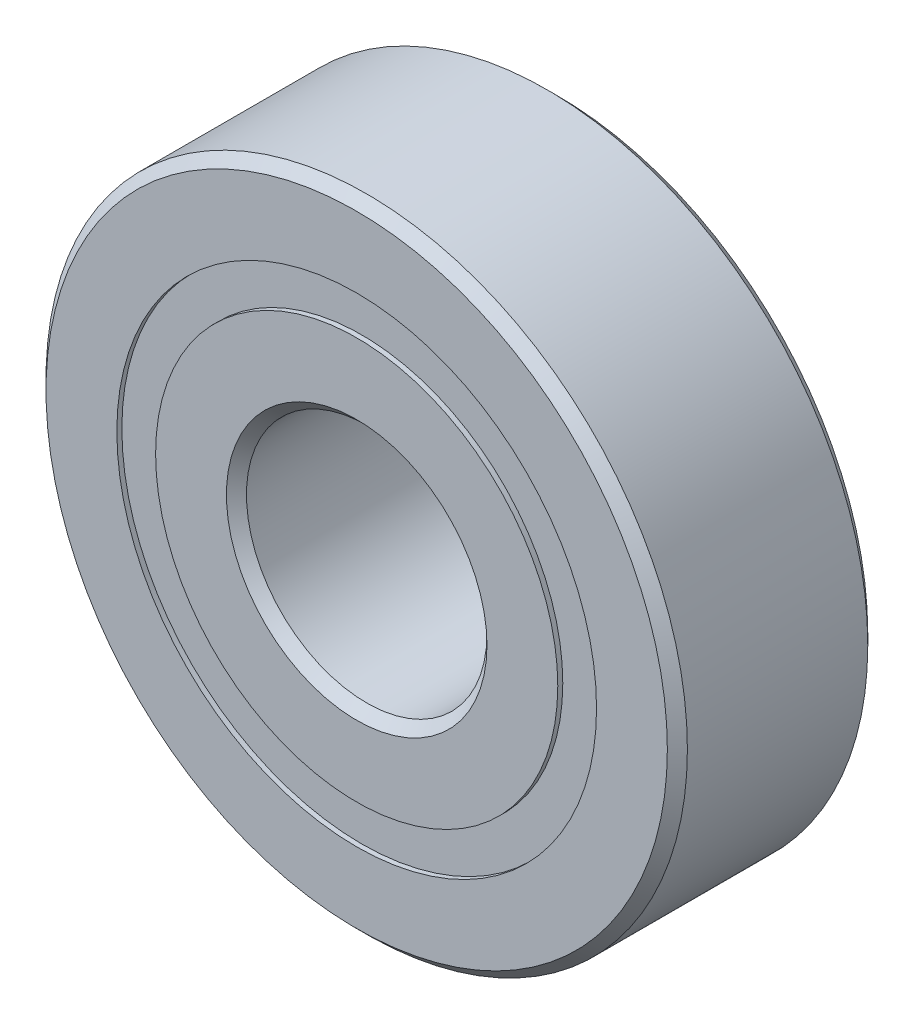
ISO-10303-21;
HEADER;
FILE_DESCRIPTION(('STEP AP214'),'2;1');
FILE_NAME('part.step','',(''),(''),'','','');
FILE_SCHEMA(('AUTOMOTIVE_DESIGN { 1 0 10303 214 1 1 1 1 }'));
ENDSEC;
DATA;
#1=APPLICATION_CONTEXT('core data for automotive mechanical design processes');
#2=APPLICATION_PROTOCOL_DEFINITION('international standard','automotive_design',2000,#1);
#3=PRODUCT_CONTEXT('',#1,'mechanical');
#4=PRODUCT('Part','Part','',(#3));
#5=PRODUCT_RELATED_PRODUCT_CATEGORY('part','',(#4));
#6=PRODUCT_DEFINITION_FORMATION('','',#4);
#7=PRODUCT_DEFINITION_CONTEXT('part definition',#1,'design');
#8=PRODUCT_DEFINITION('design','',#6,#7);
#9=PRODUCT_DEFINITION_SHAPE('','',#8);
#10=(LENGTH_UNIT() NAMED_UNIT(*) SI_UNIT(.MILLI.,.METRE.));
#11=(NAMED_UNIT(*) PLANE_ANGLE_UNIT() SI_UNIT($,.RADIAN.));
#12=(NAMED_UNIT(*) SI_UNIT($,.STERADIAN.) SOLID_ANGLE_UNIT());
#13=UNCERTAINTY_MEASURE_WITH_UNIT(LENGTH_MEASURE(1.E-05),#10,'distance_accuracy_value','');
#14=(GEOMETRIC_REPRESENTATION_CONTEXT(3) GLOBAL_UNCERTAINTY_ASSIGNED_CONTEXT((#13)) GLOBAL_UNIT_ASSIGNED_CONTEXT((#10,
#11,#12)) REPRESENTATION_CONTEXT('',''));
#15=CARTESIAN_POINT('',(0.,0.,0.));
#16=DIRECTION('',(0.,0.,1.));
#17=DIRECTION('',(1.,0.,0.));
#18=AXIS2_PLACEMENT_3D('',#15,#16,#17);
#19=CARTESIAN_POINT('',(0.,11.967032967033,-4.75));
#20=DIRECTION('',(0.,0.,1.));
#21=DIRECTION('',(1.,0.,0.));
#22=AXIS2_PLACEMENT_3D('',#19,#20,#21);
#23=PLANE('',#22);
#24=CARTESIAN_POINT('',(0.,0.,-4.75000000000001));
#25=DIRECTION('',(0.,0.,1.));
#26=DIRECTION('',(1.,0.,0.));
#27=AXIS2_PLACEMENT_3D('',#24,#25,#26);
#28=CIRCLE('',#27,11.967032967033);
#29=CARTESIAN_POINT('',(11.967032967033,0.,-4.75000000000001));
#30=VERTEX_POINT('',#29);
#31=EDGE_CURVE('E55',#30,#30,#28,.T.);
#32=ORIENTED_EDGE('',*,*,#31,.F.);
#33=EDGE_LOOP('',(#32));
#34=FACE_BOUND('',#33,.T.);
#35=CARTESIAN_POINT('',(0.,0.,-4.75000000000001));
#36=DIRECTION('',(0.,0.,1.));
#37=DIRECTION('',(1.,0.,0.));
#38=AXIS2_PLACEMENT_3D('',#35,#36,#37);
#39=CIRCLE('',#38,10.032967032967);
#40=CARTESIAN_POINT('',(10.032967032967,0.,-4.75000000000001));
#41=VERTEX_POINT('',#40);
#42=EDGE_CURVE('E11',#41,#41,#39,.T.);
#43=ORIENTED_EDGE('',*,*,#42,.T.);
#44=EDGE_LOOP('',(#43));
#45=FACE_BOUND('',#44,.T.);
#46=ADVANCED_FACE('F41',(#34,#45),#23,.F.);
#47=CARTESIAN_POINT('',(0.,0.,5.));
#48=DIRECTION('',(0.,0.,1.));
#49=DIRECTION('',(1.,0.,0.));
#50=AXIS2_PLACEMENT_3D('',#47,#48,#49);
#51=CYLINDRICAL_SURFACE('',#50,10.032967032967);
#52=ORIENTED_EDGE('',*,*,#42,.F.);
#53=EDGE_LOOP('',(#52));
#54=FACE_BOUND('',#53,.T.);
#55=CARTESIAN_POINT('',(0.,0.,-2.4235148780783));
#56=DIRECTION('',(0.,0.,1.));
#57=DIRECTION('',(1.,0.,0.));
#58=AXIS2_PLACEMENT_3D('',#55,#56,#57);
#59=CIRCLE('',#58,10.032967032967);
#60=CARTESIAN_POINT('',(10.032967032967,0.,-2.4235148780783));
#61=VERTEX_POINT('',#60);
#62=EDGE_CURVE('E47',#61,#61,#59,.T.);
#63=ORIENTED_EDGE('',*,*,#62,.T.);
#64=EDGE_LOOP('',(#63));
#65=FACE_BOUND('',#64,.T.);
#66=ADVANCED_FACE('F64',(#54,#65),#51,.F.);
#67=CARTESIAN_POINT('',(0.,11.967032967033,-2.4235148780783));
#68=DIRECTION('',(0.,0.,-1.));
#69=DIRECTION('',(-1.,0.,0.));
#70=AXIS2_PLACEMENT_3D('',#67,#68,#69);
#71=PLANE('',#70);
#72=ORIENTED_EDGE('',*,*,#62,.F.);
#73=EDGE_LOOP('',(#72));
#74=FACE_BOUND('',#73,.T.);
#75=CARTESIAN_POINT('',(0.,0.,-2.4235148780783));
#76=DIRECTION('',(0.,0.,1.));
#77=DIRECTION('',(1.,0.,0.));
#78=AXIS2_PLACEMENT_3D('',#75,#76,#77);
#79=CIRCLE('',#78,11.967032967033);
#80=CARTESIAN_POINT('',(11.967032967033,0.,-2.4235148780783));
#81=VERTEX_POINT('',#80);
#82=EDGE_CURVE('E51',#81,#81,#79,.T.);
#83=ORIENTED_EDGE('',*,*,#82,.T.);
#84=EDGE_LOOP('',(#83));
#85=FACE_BOUND('',#84,.T.);
#86=ADVANCED_FACE('F68',(#74,#85),#71,.F.);
#87=CARTESIAN_POINT('',(0.,0.,5.));
#88=DIRECTION('',(0.,0.,1.));
#89=DIRECTION('',(1.,0.,0.));
#90=AXIS2_PLACEMENT_3D('',#87,#88,#89);
#91=CYLINDRICAL_SURFACE('',#90,11.967032967033);
#92=ORIENTED_EDGE('',*,*,#82,.F.);
#93=EDGE_LOOP('',(#92));
#94=FACE_BOUND('',#93,.T.);
#95=ORIENTED_EDGE('',*,*,#31,.T.);
#96=EDGE_LOOP('',(#95));
#97=FACE_BOUND('',#96,.T.);
#98=ADVANCED_FACE('F61',(#94,#97),#91,.T.);
#99=CLOSED_SHELL('',(#46,#66,#86,#98));
#100=MANIFOLD_SOLID_BREP('B2',#99);
#101=CARTESIAN_POINT('',(0.,11.967032967033,4.75));
#102=DIRECTION('',(0.,0.,-1.));
#103=DIRECTION('',(-1.,0.,0.));
#104=AXIS2_PLACEMENT_3D('',#101,#102,#103);
#105=PLANE('',#104);
#106=CARTESIAN_POINT('',(0.,0.,4.75));
#107=DIRECTION('',(0.,0.,1.));
#108=DIRECTION('',(1.,0.,0.));
#109=AXIS2_PLACEMENT_3D('',#106,#107,#108);
#110=CIRCLE('',#109,10.032967032967);
#111=CARTESIAN_POINT('',(10.032967032967,0.,4.75));
#112=VERTEX_POINT('',#111);
#113=EDGE_CURVE('E40',#112,#112,#110,.T.);
#114=ORIENTED_EDGE('',*,*,#113,.F.);
#115=EDGE_LOOP('',(#114));
#116=FACE_BOUND('',#115,.T.);
#117=CARTESIAN_POINT('',(0.,0.,4.75));
#118=DIRECTION('',(0.,0.,1.));
#119=DIRECTION('',(1.,0.,0.));
#120=AXIS2_PLACEMENT_3D('',#117,#118,#119);
#121=CIRCLE('',#120,11.967032967033);
#122=CARTESIAN_POINT('',(11.967032967033,0.,4.75));
#123=VERTEX_POINT('',#122);
#124=EDGE_CURVE('E122',#123,#123,#121,.T.);
#125=ORIENTED_EDGE('',*,*,#124,.T.);
#126=EDGE_LOOP('',(#125));
#127=FACE_BOUND('',#126,.T.);
#128=ADVANCED_FACE('F108',(#116,#127),#105,.F.);
#129=CARTESIAN_POINT('',(0.,0.,5.));
#130=DIRECTION('',(0.,0.,1.));
#131=DIRECTION('',(1.,0.,0.));
#132=AXIS2_PLACEMENT_3D('',#129,#130,#131);
#133=CYLINDRICAL_SURFACE('',#132,10.032967032967);
#134=CARTESIAN_POINT('',(0.,0.,2.42351487807829));
#135=DIRECTION('',(0.,0.,1.));
#136=DIRECTION('',(1.,0.,0.));
#137=AXIS2_PLACEMENT_3D('',#134,#135,#136);
#138=CIRCLE('',#137,10.032967032967);
#139=CARTESIAN_POINT('',(10.032967032967,0.,2.42351487807829));
#140=VERTEX_POINT('',#139);
#141=EDGE_CURVE('E114',#140,#140,#138,.T.);
#142=ORIENTED_EDGE('',*,*,#141,.F.);
#143=EDGE_LOOP('',(#142));
#144=FACE_BOUND('',#143,.T.);
#145=ORIENTED_EDGE('',*,*,#113,.T.);
#146=EDGE_LOOP('',(#145));
#147=FACE_BOUND('',#146,.T.);
#148=ADVANCED_FACE('F137',(#144,#147),#133,.F.);
#149=CARTESIAN_POINT('',(0.,11.967032967033,2.42351487807829));
#150=DIRECTION('',(0.,0.,1.));
#151=DIRECTION('',(1.,0.,0.));
#152=AXIS2_PLACEMENT_3D('',#149,#150,#151);
#153=PLANE('',#152);
#154=CARTESIAN_POINT('',(0.,0.,2.42351487807829));
#155=DIRECTION('',(0.,0.,1.));
#156=DIRECTION('',(1.,0.,0.));
#157=AXIS2_PLACEMENT_3D('',#154,#155,#156);
#158=CIRCLE('',#157,11.967032967033);
#159=CARTESIAN_POINT('',(11.967032967033,0.,2.42351487807829));
#160=VERTEX_POINT('',#159);
#161=EDGE_CURVE('E118',#160,#160,#158,.T.);
#162=ORIENTED_EDGE('',*,*,#161,.F.);
#163=EDGE_LOOP('',(#162));
#164=FACE_BOUND('',#163,.T.);
#165=ORIENTED_EDGE('',*,*,#141,.T.);
#166=EDGE_LOOP('',(#165));
#167=FACE_BOUND('',#166,.T.);
#168=ADVANCED_FACE('F132',(#164,#167),#153,.F.);
#169=CARTESIAN_POINT('',(0.,0.,5.));
#170=DIRECTION('',(0.,0.,1.));
#171=DIRECTION('',(1.,0.,0.));
#172=AXIS2_PLACEMENT_3D('',#169,#170,#171);
#173=CYLINDRICAL_SURFACE('',#172,11.967032967033);
#174=ORIENTED_EDGE('',*,*,#124,.F.);
#175=EDGE_LOOP('',(#174));
#176=FACE_BOUND('',#175,.T.);
#177=ORIENTED_EDGE('',*,*,#161,.T.);
#178=EDGE_LOOP('',(#177));
#179=FACE_BOUND('',#178,.T.);
#180=ADVANCED_FACE('F129',(#176,#179),#173,.T.);
#181=CLOSED_SHELL('',(#128,#148,#168,#180));
#182=MANIFOLD_SOLID_BREP('B6',#181);
#183=CARTESIAN_POINT('',(-5.49999999999988,9.5262794416289,0.));
#184=DIRECTION('',(0.,0.,1.));
#185=DIRECTION('',(-0.499999999999989,0.866025403784445,0.));
#186=AXIS2_PLACEMENT_3D('',#183,#184,#185);
#187=SPHERICAL_SURFACE('',#186,2.42351487807829);
#188=CARTESIAN_POINT('',(-5.49999999999988,9.5262794416289,2.42351487807829));
#189=VERTEX_POINT('',#188);
#190=VERTEX_LOOP('',#189);
#191=FACE_BOUND('',#190,.T.);
#192=ADVANCED_FACE('F175',(#191),#187,.T.);
#193=CLOSED_SHELL('',(#192));
#194=MANIFOLD_SOLID_BREP('B35',#193);
#195=CARTESIAN_POINT('',(-9.52627944162876,5.50000000000011,0.));
#196=DIRECTION('',(0.,0.,1.));
#197=DIRECTION('',(-0.866025403784433,0.50000000000001,0.));
#198=AXIS2_PLACEMENT_3D('',#195,#196,#197);
#199=SPHERICAL_SURFACE('',#198,2.42351487807829);
#200=CARTESIAN_POINT('',(-9.52627944162876,5.50000000000011,2.42351487807829));
#201=VERTEX_POINT('',#200);
#202=VERTEX_LOOP('',#201);
#203=FACE_BOUND('',#202,.T.);
#204=ADVANCED_FACE('F195',(#203),#199,.T.);
#205=CLOSED_SHELL('',(#204));
#206=MANIFOLD_SOLID_BREP('B104',#205);
#207=CARTESIAN_POINT('',(-11.,1.15218884181823E-13,0.));
#208=DIRECTION('',(0.,0.,1.));
#209=DIRECTION('',(-1.,0.,0.));
#210=AXIS2_PLACEMENT_3D('',#207,#208,#209);
#211=SPHERICAL_SURFACE('',#210,2.42351487807829);
#212=CARTESIAN_POINT('',(-11.,1.15218884181823E-13,2.42351487807829));
#213=VERTEX_POINT('',#212);
#214=VERTEX_LOOP('',#213);
#215=FACE_BOUND('',#214,.T.);
#216=ADVANCED_FACE('F215',(#215),#211,.T.);
#217=CLOSED_SHELL('',(#216));
#218=MANIFOLD_SOLID_BREP('B171',#217);
#219=CARTESIAN_POINT('',(-9.52627944162887,-5.49999999999991,0.));
#220=DIRECTION('',(0.,0.,1.));
#221=DIRECTION('',(-0.866025403784443,-0.499999999999992,0.));
#222=AXIS2_PLACEMENT_3D('',#219,#220,#221);
#223=SPHERICAL_SURFACE('',#222,2.42351487807829);
#224=CARTESIAN_POINT('',(-9.52627944162887,-5.49999999999991,2.42351487807829));
#225=VERTEX_POINT('',#224);
#226=VERTEX_LOOP('',#225);
#227=FACE_BOUND('',#226,.T.);
#228=ADVANCED_FACE('F235',(#227),#223,.T.);
#229=CLOSED_SHELL('',(#228));
#230=MANIFOLD_SOLID_BREP('B191',#229);
#231=CARTESIAN_POINT('',(-5.50000000000008,-9.52627944162878,0.));
#232=DIRECTION('',(0.,0.,1.));
#233=DIRECTION('',(-0.500000000000007,-0.866025403784435,0.));
#234=AXIS2_PLACEMENT_3D('',#231,#232,#233);
#235=SPHERICAL_SURFACE('',#234,2.42351487807829);
#236=CARTESIAN_POINT('',(-5.50000000000008,-9.52627944162878,2.42351487807829));
#237=VERTEX_POINT('',#236);
#238=VERTEX_LOOP('',#237);
#239=FACE_BOUND('',#238,.T.);
#240=ADVANCED_FACE('F255',(#239),#235,.T.);
#241=CLOSED_SHELL('',(#240));
#242=MANIFOLD_SOLID_BREP('B211',#241);
#243=CARTESIAN_POINT('',(0.,-11.,0.));
#244=DIRECTION('',(0.,0.,1.));
#245=DIRECTION('',(0.,-1.,0.));
#246=AXIS2_PLACEMENT_3D('',#243,#244,#245);
#247=SPHERICAL_SURFACE('',#246,2.42351487807829);
#248=CARTESIAN_POINT('',(0.,-11.,2.42351487807829));
#249=VERTEX_POINT('',#248);
#250=VERTEX_LOOP('',#249);
#251=FACE_BOUND('',#250,.T.);
#252=ADVANCED_FACE('F275',(#251),#247,.T.);
#253=CLOSED_SHELL('',(#252));
#254=MANIFOLD_SOLID_BREP('B231',#253);
#255=CARTESIAN_POINT('',(5.49999999999994,-9.52627944162886,0.));
#256=DIRECTION('',(0.,0.,1.));
#257=DIRECTION('',(0.499999999999995,-0.866025403784442,0.));
#258=AXIS2_PLACEMENT_3D('',#255,#256,#257);
#259=SPHERICAL_SURFACE('',#258,2.42351487807829);
#260=CARTESIAN_POINT('',(5.49999999999994,-9.52627944162886,2.42351487807829));
#261=VERTEX_POINT('',#260);
#262=VERTEX_LOOP('',#261);
#263=FACE_BOUND('',#262,.T.);
#264=ADVANCED_FACE('F295',(#263),#259,.T.);
#265=CLOSED_SHELL('',(#264));
#266=MANIFOLD_SOLID_BREP('B251',#265);
#267=CARTESIAN_POINT('',(9.5262794416288,-5.50000000000004,0.));
#268=DIRECTION('',(0.,0.,1.));
#269=DIRECTION('',(0.866025403784436,-0.500000000000004,0.));
#270=AXIS2_PLACEMENT_3D('',#267,#268,#269);
#271=SPHERICAL_SURFACE('',#270,2.42351487807829);
#272=CARTESIAN_POINT('',(9.5262794416288,-5.50000000000004,2.42351487807829));
#273=VERTEX_POINT('',#272);
#274=VERTEX_LOOP('',#273);
#275=FACE_BOUND('',#274,.T.);
#276=ADVANCED_FACE('F315',(#275),#271,.T.);
#277=CLOSED_SHELL('',(#276));
#278=MANIFOLD_SOLID_BREP('B271',#277);
#279=CARTESIAN_POINT('',(11.,0.,0.));
#280=DIRECTION('',(0.,0.,1.));
#281=DIRECTION('',(1.,0.,0.));
#282=AXIS2_PLACEMENT_3D('',#279,#280,#281);
#283=SPHERICAL_SURFACE('',#282,2.42351487807829);
#284=CARTESIAN_POINT('',(11.,0.,2.42351487807829));
#285=VERTEX_POINT('',#284);
#286=VERTEX_LOOP('',#285);
#287=FACE_BOUND('',#286,.T.);
#288=ADVANCED_FACE('F335',(#287),#283,.T.);
#289=CLOSED_SHELL('',(#288));
#290=MANIFOLD_SOLID_BREP('B291',#289);
#291=CARTESIAN_POINT('',(9.52627944162884,5.49999999999998,0.));
#292=DIRECTION('',(0.,0.,1.));
#293=DIRECTION('',(0.86602540378444,0.499999999999998,0.));
#294=AXIS2_PLACEMENT_3D('',#291,#292,#293);
#295=SPHERICAL_SURFACE('',#294,2.42351487807829);
#296=CARTESIAN_POINT('',(9.52627944162884,5.49999999999998,2.42351487807829));
#297=VERTEX_POINT('',#296);
#298=VERTEX_LOOP('',#297);
#299=FACE_BOUND('',#298,.T.);
#300=ADVANCED_FACE('F355',(#299),#295,.T.);
#301=CLOSED_SHELL('',(#300));
#302=MANIFOLD_SOLID_BREP('B311',#301);
#303=CARTESIAN_POINT('',(5.50000000000001,9.52627944162882,0.));
#304=DIRECTION('',(0.,0.,1.));
#305=DIRECTION('',(0.500000000000001,0.866025403784438,0.));
#306=AXIS2_PLACEMENT_3D('',#303,#304,#305);
#307=SPHERICAL_SURFACE('',#306,2.42351487807829);
#308=CARTESIAN_POINT('',(5.50000000000001,9.52627944162882,2.42351487807829));
#309=VERTEX_POINT('',#308);
#310=VERTEX_LOOP('',#309);
#311=FACE_BOUND('',#310,.T.);
#312=ADVANCED_FACE('F375',(#311),#307,.T.);
#313=CLOSED_SHELL('',(#312));
#314=MANIFOLD_SOLID_BREP('B331',#313);
#315=CARTESIAN_POINT('',(0.,11.,0.));
#316=DIRECTION('',(0.,0.,1.));
#317=DIRECTION('',(0.,1.,0.));
#318=AXIS2_PLACEMENT_3D('',#315,#316,#317);
#319=SPHERICAL_SURFACE('',#318,2.42351487807829);
#320=CARTESIAN_POINT('',(0.,11.,2.42351487807829));
#321=VERTEX_POINT('',#320);
#322=VERTEX_LOOP('',#321);
#323=FACE_BOUND('',#322,.T.);
#324=ADVANCED_FACE('F397',(#323),#319,.T.);
#325=CLOSED_SHELL('',(#324));
#326=MANIFOLD_SOLID_BREP('B351',#325);
#327=CARTESIAN_POINT('',(0.,10.032967032967,5.));
#328=DIRECTION('',(0.,0.,-1.));
#329=DIRECTION('',(-1.,0.,0.));
#330=AXIS2_PLACEMENT_3D('',#327,#328,#329);
#331=PLANE('',#330);
#332=CARTESIAN_POINT('',(0.,0.,5.));
#333=DIRECTION('',(0.,0.,1.));
#334=DIRECTION('',(1.,0.,0.));
#335=AXIS2_PLACEMENT_3D('',#332,#333,#334);
#336=CIRCLE('',#335,6.5);
#337=CARTESIAN_POINT('',(6.5,0.,5.));
#338=VERTEX_POINT('',#337);
#339=EDGE_CURVE('E444',#338,#338,#336,.T.);
#340=ORIENTED_EDGE('',*,*,#339,.F.);
#341=EDGE_LOOP('',(#340));
#342=FACE_BOUND('',#341,.T.);
#343=CARTESIAN_POINT('',(0.,0.,5.));
#344=DIRECTION('',(0.,0.,1.));
#345=DIRECTION('',(1.,0.,0.));
#346=AXIS2_PLACEMENT_3D('',#343,#344,#345);
#347=CIRCLE('',#346,10.032967032967);
#348=CARTESIAN_POINT('',(10.032967032967,0.,5.));
#349=VERTEX_POINT('',#348);
#350=EDGE_CURVE('E396',#349,#349,#347,.T.);
#351=ORIENTED_EDGE('',*,*,#350,.T.);
#352=EDGE_LOOP('',(#351));
#353=FACE_BOUND('',#352,.T.);
#354=ADVANCED_FACE('F416',(#342,#353),#331,.F.);
#355=CARTESIAN_POINT('',(0.,0.,5.));
#356=DIRECTION('',(0.,0.,1.));
#357=DIRECTION('',(1.,0.,0.));
#358=AXIS2_PLACEMENT_3D('',#355,#356,#357);
#359=CYLINDRICAL_SURFACE('',#358,10.032967032967);
#360=ORIENTED_EDGE('',*,*,#350,.F.);
#361=EDGE_LOOP('',(#360));
#362=FACE_BOUND('',#361,.T.);
#363=CARTESIAN_POINT('',(0.,0.,2.22222222222222));
#364=DIRECTION('',(0.,0.,1.));
#365=DIRECTION('',(1.,0.,0.));
#366=AXIS2_PLACEMENT_3D('',#363,#364,#365);
#367=CIRCLE('',#366,10.032967032967);
#368=CARTESIAN_POINT('',(10.032967032967,0.,2.22222222222222));
#369=VERTEX_POINT('',#368);
#370=EDGE_CURVE('E422',#369,#369,#367,.T.);
#371=ORIENTED_EDGE('',*,*,#370,.T.);
#372=EDGE_LOOP('',(#371));
#373=FACE_BOUND('',#372,.T.);
#374=ADVANCED_FACE('F451',(#362,#373),#359,.T.);
#375=CARTESIAN_POINT('',(0.,0.,0.));
#376=DIRECTION('',(0.,0.,1.));
#377=DIRECTION('',(1.,0.,0.));
#378=AXIS2_PLACEMENT_3D('',#375,#376,#377);
#379=TOROIDAL_SURFACE('',#378,11.,2.42351487807829);
#380=ORIENTED_EDGE('',*,*,#370,.F.);
#381=EDGE_LOOP('',(#380));
#382=FACE_BOUND('',#381,.T.);
#383=CARTESIAN_POINT('',(0.,0.,-2.22222222222223));
#384=DIRECTION('',(0.,0.,1.));
#385=DIRECTION('',(1.,0.,0.));
#386=AXIS2_PLACEMENT_3D('',#383,#384,#385);
#387=CIRCLE('',#386,10.032967032967);
#388=CARTESIAN_POINT('',(10.032967032967,0.,-2.22222222222223));
#389=VERTEX_POINT('',#388);
#390=EDGE_CURVE('E426',#389,#389,#387,.T.);
#391=ORIENTED_EDGE('',*,*,#390,.T.);
#392=EDGE_LOOP('',(#391));
#393=FACE_BOUND('',#392,.T.);
#394=ADVANCED_FACE('F455',(#382,#393),#379,.F.);
#395=CARTESIAN_POINT('',(0.,0.,5.));
#396=DIRECTION('',(0.,0.,1.));
#397=DIRECTION('',(1.,0.,0.));
#398=AXIS2_PLACEMENT_3D('',#395,#396,#397);
#399=CYLINDRICAL_SURFACE('',#398,10.032967032967);
#400=ORIENTED_EDGE('',*,*,#390,.F.);
#401=EDGE_LOOP('',(#400));
#402=FACE_BOUND('',#401,.T.);
#403=CARTESIAN_POINT('',(0.,0.,-5.));
#404=DIRECTION('',(0.,0.,1.));
#405=DIRECTION('',(1.,0.,0.));
#406=AXIS2_PLACEMENT_3D('',#403,#404,#405);
#407=CIRCLE('',#406,10.032967032967);
#408=CARTESIAN_POINT('',(10.032967032967,0.,-5.));
#409=VERTEX_POINT('',#408);
#410=EDGE_CURVE('E430',#409,#409,#407,.T.);
#411=ORIENTED_EDGE('',*,*,#410,.T.);
#412=EDGE_LOOP('',(#411));
#413=FACE_BOUND('',#412,.T.);
#414=ADVANCED_FACE('F460',(#402,#413),#399,.T.);
#415=CARTESIAN_POINT('',(0.,6.5,-5.));
#416=DIRECTION('',(0.,0.,1.));
#417=DIRECTION('',(1.,0.,0.));
#418=AXIS2_PLACEMENT_3D('',#415,#416,#417);
#419=PLANE('',#418);
#420=ORIENTED_EDGE('',*,*,#410,.F.);
#421=EDGE_LOOP('',(#420));
#422=FACE_BOUND('',#421,.T.);
#423=CARTESIAN_POINT('',(0.,0.,-5.00000000000001));
#424=DIRECTION('',(0.,0.,1.));
#425=DIRECTION('',(1.,0.,0.));
#426=AXIS2_PLACEMENT_3D('',#423,#424,#425);
#427=CIRCLE('',#426,6.5);
#428=CARTESIAN_POINT('',(6.5,0.,-5.00000000000001));
#429=VERTEX_POINT('',#428);
#430=EDGE_CURVE('E435',#429,#429,#427,.T.);
#431=ORIENTED_EDGE('',*,*,#430,.T.);
#432=EDGE_LOOP('',(#431));
#433=FACE_BOUND('',#432,.T.);
#434=ADVANCED_FACE('F466',(#422,#433),#419,.F.);
#435=CARTESIAN_POINT('',(0.,0.,-4.5));
#436=DIRECTION('',(0.,0.,-1.));
#437=DIRECTION('',(-1.,0.,0.));
#438=AXIS2_PLACEMENT_3D('',#435,#436,#437);
#439=CONICAL_SURFACE('',#438,6.,0.785398163397446);
#440=ORIENTED_EDGE('',*,*,#430,.F.);
#441=EDGE_LOOP('',(#440));
#442=FACE_BOUND('',#441,.T.);
#443=CARTESIAN_POINT('',(0.,0.,-4.5));
#444=DIRECTION('',(0.,0.,1.));
#445=DIRECTION('',(1.,0.,0.));
#446=AXIS2_PLACEMENT_3D('',#443,#444,#445);
#447=CIRCLE('',#446,6.);
#448=CARTESIAN_POINT('',(6.,0.,-4.5));
#449=VERTEX_POINT('',#448);
#450=EDGE_CURVE('E438',#449,#449,#447,.T.);
#451=ORIENTED_EDGE('',*,*,#450,.T.);
#452=EDGE_LOOP('',(#451));
#453=FACE_BOUND('',#452,.T.);
#454=ADVANCED_FACE('F470',(#442,#453),#439,.F.);
#455=CARTESIAN_POINT('',(0.,0.,5.));
#456=DIRECTION('',(0.,0.,1.));
#457=DIRECTION('',(1.,0.,0.));
#458=AXIS2_PLACEMENT_3D('',#455,#456,#457);
#459=CYLINDRICAL_SURFACE('',#458,6.);
#460=ORIENTED_EDGE('',*,*,#450,.F.);
#461=EDGE_LOOP('',(#460));
#462=FACE_BOUND('',#461,.T.);
#463=CARTESIAN_POINT('',(0.,0.,4.5));
#464=DIRECTION('',(0.,0.,1.));
#465=DIRECTION('',(1.,0.,0.));
#466=AXIS2_PLACEMENT_3D('',#463,#464,#465);
#467=CIRCLE('',#466,6.);
#468=CARTESIAN_POINT('',(6.,0.,4.5));
#469=VERTEX_POINT('',#468);
#470=EDGE_CURVE('E441',#469,#469,#467,.T.);
#471=ORIENTED_EDGE('',*,*,#470,.T.);
#472=EDGE_LOOP('',(#471));
#473=FACE_BOUND('',#472,.T.);
#474=ADVANCED_FACE('F474',(#462,#473),#459,.F.);
#475=CARTESIAN_POINT('',(0.,0.,5.));
#476=DIRECTION('',(0.,0.,1.));
#477=DIRECTION('',(1.,0.,0.));
#478=AXIS2_PLACEMENT_3D('',#475,#476,#477);
#479=CONICAL_SURFACE('',#478,6.5,0.785398163397449);
#480=ORIENTED_EDGE('',*,*,#470,.F.);
#481=EDGE_LOOP('',(#480));
#482=FACE_BOUND('',#481,.T.);
#483=ORIENTED_EDGE('',*,*,#339,.T.);
#484=EDGE_LOOP('',(#483));
#485=FACE_BOUND('',#484,.T.);
#486=ADVANCED_FACE('F448',(#482,#485),#479,.F.);
#487=CLOSED_SHELL('',(#354,#374,#394,#414,#434,#454,#474,#486));
#488=MANIFOLD_SOLID_BREP('B371',#487);
#489=CARTESIAN_POINT('',(0.,0.,4.5));
#490=DIRECTION('',(0.,0.,-1.));
#491=DIRECTION('',(-1.,0.,0.));
#492=AXIS2_PLACEMENT_3D('',#489,#490,#491);
#493=CONICAL_SURFACE('',#492,16.,0.785398163397447);
#494=CARTESIAN_POINT('',(0.,0.,5.));
#495=DIRECTION('',(0.,0.,1.));
#496=DIRECTION('',(1.,0.,0.));
#497=AXIS2_PLACEMENT_3D('',#494,#495,#496);
#498=CIRCLE('',#497,15.5);
#499=CARTESIAN_POINT('',(15.5,0.,5.));
#500=VERTEX_POINT('',#499);
#501=EDGE_CURVE('E565',#500,#500,#498,.T.);
#502=ORIENTED_EDGE('',*,*,#501,.F.);
#503=EDGE_LOOP('',(#502));
#504=FACE_BOUND('',#503,.T.);
#505=CARTESIAN_POINT('',(0.,0.,4.5));
#506=DIRECTION('',(0.,0.,1.));
#507=DIRECTION('',(1.,0.,0.));
#508=AXIS2_PLACEMENT_3D('',#505,#506,#507);
#509=CIRCLE('',#508,16.);
#510=CARTESIAN_POINT('',(16.,0.,4.5));
#511=VERTEX_POINT('',#510);
#512=EDGE_CURVE('E415',#511,#511,#509,.T.);
#513=ORIENTED_EDGE('',*,*,#512,.T.);
#514=EDGE_LOOP('',(#513));
#515=FACE_BOUND('',#514,.T.);
#516=ADVANCED_FACE('F537',(#504,#515),#493,.T.);
#517=CARTESIAN_POINT('',(0.,0.,5.));
#518=DIRECTION('',(0.,0.,1.));
#519=DIRECTION('',(1.,0.,0.));
#520=AXIS2_PLACEMENT_3D('',#517,#518,#519);
#521=CYLINDRICAL_SURFACE('',#520,16.);
#522=ORIENTED_EDGE('',*,*,#512,.F.);
#523=EDGE_LOOP('',(#522));
#524=FACE_BOUND('',#523,.T.);
#525=CARTESIAN_POINT('',(0.,0.,-4.5));
#526=DIRECTION('',(0.,0.,1.));
#527=DIRECTION('',(1.,0.,0.));
#528=AXIS2_PLACEMENT_3D('',#525,#526,#527);
#529=CIRCLE('',#528,16.);
#530=CARTESIAN_POINT('',(16.,0.,-4.5));
#531=VERTEX_POINT('',#530);
#532=EDGE_CURVE('E543',#531,#531,#529,.T.);
#533=ORIENTED_EDGE('',*,*,#532,.T.);
#534=EDGE_LOOP('',(#533));
#535=FACE_BOUND('',#534,.T.);
#536=ADVANCED_FACE('F572',(#524,#535),#521,.T.);
#537=CARTESIAN_POINT('',(0.,0.,-5.));
#538=DIRECTION('',(0.,0.,1.));
#539=DIRECTION('',(1.,0.,0.));
#540=AXIS2_PLACEMENT_3D('',#537,#538,#539);
#541=CONICAL_SURFACE('',#540,15.5,0.785398163397447);
#542=ORIENTED_EDGE('',*,*,#532,.F.);
#543=EDGE_LOOP('',(#542));
#544=FACE_BOUND('',#543,.T.);
#545=CARTESIAN_POINT('',(0.,0.,-5.));
#546=DIRECTION('',(0.,0.,1.));
#547=DIRECTION('',(1.,0.,0.));
#548=AXIS2_PLACEMENT_3D('',#545,#546,#547);
#549=CIRCLE('',#548,15.5);
#550=CARTESIAN_POINT('',(15.5,0.,-5.));
#551=VERTEX_POINT('',#550);
#552=EDGE_CURVE('E547',#551,#551,#549,.T.);
#553=ORIENTED_EDGE('',*,*,#552,.T.);
#554=EDGE_LOOP('',(#553));
#555=FACE_BOUND('',#554,.T.);
#556=ADVANCED_FACE('F576',(#544,#555),#541,.T.);
#557=CARTESIAN_POINT('',(0.,15.5,-5.));
#558=DIRECTION('',(0.,0.,1.));
#559=DIRECTION('',(1.,0.,0.));
#560=AXIS2_PLACEMENT_3D('',#557,#558,#559);
#561=PLANE('',#560);
#562=ORIENTED_EDGE('',*,*,#552,.F.);
#563=EDGE_LOOP('',(#562));
#564=FACE_BOUND('',#563,.T.);
#565=CARTESIAN_POINT('',(0.,0.,-5.00000000000001));
#566=DIRECTION('',(0.,0.,1.));
#567=DIRECTION('',(1.,0.,0.));
#568=AXIS2_PLACEMENT_3D('',#565,#566,#567);
#569=CIRCLE('',#568,11.967032967033);
#570=CARTESIAN_POINT('',(11.967032967033,0.,-5.00000000000001));
#571=VERTEX_POINT('',#570);
#572=EDGE_CURVE('E551',#571,#571,#569,.T.);
#573=ORIENTED_EDGE('',*,*,#572,.T.);
#574=EDGE_LOOP('',(#573));
#575=FACE_BOUND('',#574,.T.);
#576=ADVANCED_FACE('F581',(#564,#575),#561,.F.);
#577=CARTESIAN_POINT('',(0.,0.,5.));
#578=DIRECTION('',(0.,0.,1.));
#579=DIRECTION('',(1.,0.,0.));
#580=AXIS2_PLACEMENT_3D('',#577,#578,#579);
#581=CYLINDRICAL_SURFACE('',#580,11.967032967033);
#582=ORIENTED_EDGE('',*,*,#572,.F.);
#583=EDGE_LOOP('',(#582));
#584=FACE_BOUND('',#583,.T.);
#585=CARTESIAN_POINT('',(0.,0.,-2.22222222222222));
#586=DIRECTION('',(0.,0.,1.));
#587=DIRECTION('',(1.,0.,0.));
#588=AXIS2_PLACEMENT_3D('',#585,#586,#587);
#589=CIRCLE('',#588,11.967032967033);
#590=CARTESIAN_POINT('',(11.967032967033,0.,-2.22222222222222));
#591=VERTEX_POINT('',#590);
#592=EDGE_CURVE('E556',#591,#591,#589,.T.);
#593=ORIENTED_EDGE('',*,*,#592,.T.);
#594=EDGE_LOOP('',(#593));
#595=FACE_BOUND('',#594,.T.);
#596=ADVANCED_FACE('F587',(#584,#595),#581,.F.);
#597=CARTESIAN_POINT('',(0.,0.,0.));
#598=DIRECTION('',(0.,0.,1.));
#599=DIRECTION('',(1.,0.,0.));
#600=AXIS2_PLACEMENT_3D('',#597,#598,#599);
#601=TOROIDAL_SURFACE('',#600,11.,2.42351487807829);
#602=ORIENTED_EDGE('',*,*,#592,.F.);
#603=EDGE_LOOP('',(#602));
#604=FACE_BOUND('',#603,.T.);
#605=CARTESIAN_POINT('',(0.,0.,2.22222222222222));
#606=DIRECTION('',(0.,0.,1.));
#607=DIRECTION('',(1.,0.,0.));
#608=AXIS2_PLACEMENT_3D('',#605,#606,#607);
#609=CIRCLE('',#608,11.967032967033);
#610=CARTESIAN_POINT('',(11.967032967033,0.,2.22222222222222));
#611=VERTEX_POINT('',#610);
#612=EDGE_CURVE('E559',#611,#611,#609,.T.);
#613=ORIENTED_EDGE('',*,*,#612,.T.);
#614=EDGE_LOOP('',(#613));
#615=FACE_BOUND('',#614,.T.);
#616=ADVANCED_FACE('F591',(#604,#615),#601,.F.);
#617=CARTESIAN_POINT('',(0.,0.,5.));
#618=DIRECTION('',(0.,0.,1.));
#619=DIRECTION('',(1.,0.,0.));
#620=AXIS2_PLACEMENT_3D('',#617,#618,#619);
#621=CYLINDRICAL_SURFACE('',#620,11.967032967033);
#622=ORIENTED_EDGE('',*,*,#612,.F.);
#623=EDGE_LOOP('',(#622));
#624=FACE_BOUND('',#623,.T.);
#625=CARTESIAN_POINT('',(0.,0.,5.));
#626=DIRECTION('',(0.,0.,1.));
#627=DIRECTION('',(1.,0.,0.));
#628=AXIS2_PLACEMENT_3D('',#625,#626,#627);
#629=CIRCLE('',#628,11.967032967033);
#630=CARTESIAN_POINT('',(11.967032967033,0.,5.));
#631=VERTEX_POINT('',#630);
#632=EDGE_CURVE('E562',#631,#631,#629,.T.);
#633=ORIENTED_EDGE('',*,*,#632,.T.);
#634=EDGE_LOOP('',(#633));
#635=FACE_BOUND('',#634,.T.);
#636=ADVANCED_FACE('F595',(#624,#635),#621,.F.);
#637=CARTESIAN_POINT('',(0.,15.5,5.));
#638=DIRECTION('',(0.,0.,-1.));
#639=DIRECTION('',(-1.,0.,0.));
#640=AXIS2_PLACEMENT_3D('',#637,#638,#639);
#641=PLANE('',#640);
#642=ORIENTED_EDGE('',*,*,#632,.F.);
#643=EDGE_LOOP('',(#642));
#644=FACE_BOUND('',#643,.T.);
#645=ORIENTED_EDGE('',*,*,#501,.T.);
#646=EDGE_LOOP('',(#645));
#647=FACE_BOUND('',#646,.T.);
#648=ADVANCED_FACE('F569',(#644,#647),#641,.F.);
#649=CLOSED_SHELL('',(#516,#536,#556,#576,#596,#616,#636,#648));
#650=MANIFOLD_SOLID_BREP('B391',#649);
#651=ADVANCED_BREP_SHAPE_REPRESENTATION('',(#18,#100,#182,#194,#206,#218,#230,#242,#254,#266,
#278,#290,#302,#314,#326,#488,#650),#14);
#652=SHAPE_DEFINITION_REPRESENTATION(#9,#651);
ENDSEC;
END-ISO-10303-21;
